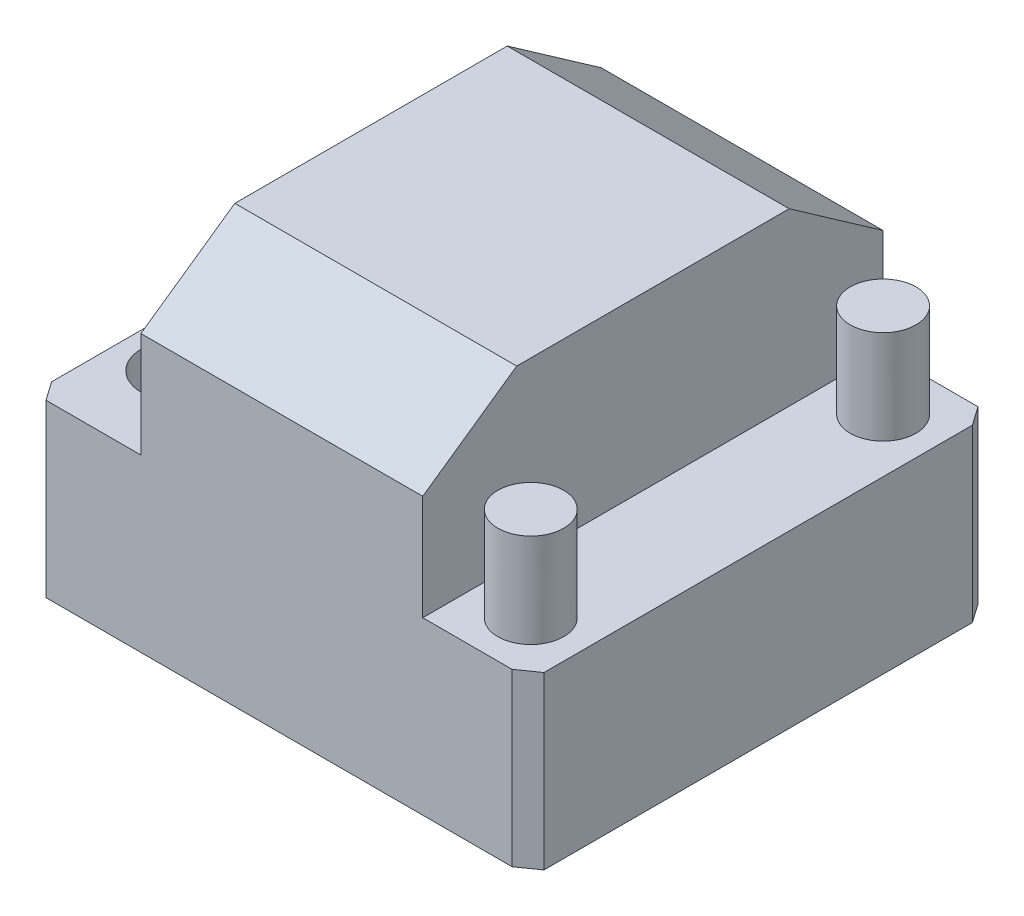
ISO-10303-21;
HEADER;
FILE_DESCRIPTION(('STEP AP214'),'2;1');
FILE_NAME('part.step','',(''),(''),'','','');
FILE_SCHEMA(('AUTOMOTIVE_DESIGN { 1 0 10303 214 1 1 1 1 }'));
ENDSEC;
DATA;
#1=APPLICATION_CONTEXT('core data for automotive mechanical design processes');
#2=APPLICATION_PROTOCOL_DEFINITION('international standard','automotive_design',2000,#1);
#3=PRODUCT_CONTEXT('',#1,'mechanical');
#4=PRODUCT('Part','Part','',(#3));
#5=PRODUCT_RELATED_PRODUCT_CATEGORY('part','',(#4));
#6=PRODUCT_DEFINITION_FORMATION('','',#4);
#7=PRODUCT_DEFINITION_CONTEXT('part definition',#1,'design');
#8=PRODUCT_DEFINITION('design','',#6,#7);
#9=PRODUCT_DEFINITION_SHAPE('','',#8);
#10=(LENGTH_UNIT() NAMED_UNIT(*) SI_UNIT(.MILLI.,.METRE.));
#11=(NAMED_UNIT(*) PLANE_ANGLE_UNIT() SI_UNIT($,.RADIAN.));
#12=(NAMED_UNIT(*) SI_UNIT($,.STERADIAN.) SOLID_ANGLE_UNIT());
#13=UNCERTAINTY_MEASURE_WITH_UNIT(LENGTH_MEASURE(1.E-05),#10,'distance_accuracy_value','');
#14=(GEOMETRIC_REPRESENTATION_CONTEXT(3) GLOBAL_UNCERTAINTY_ASSIGNED_CONTEXT((#13)) GLOBAL_UNIT_ASSIGNED_CONTEXT((#10,
#11,#12)) REPRESENTATION_CONTEXT('',''));
#15=CARTESIAN_POINT('',(0.,0.,0.));
#16=DIRECTION('',(0.,0.,1.));
#17=DIRECTION('',(1.,0.,0.));
#18=AXIS2_PLACEMENT_3D('',#15,#16,#17);
#19=CARTESIAN_POINT('',(-26.5,36.4,-24.5));
#20=DIRECTION('',(1.,0.,0.));
#21=DIRECTION('',(0.,0.,-1.));
#22=AXIS2_PLACEMENT_3D('',#19,#20,#21);
#23=PLANE('',#22);
#24=DIRECTION('',(0.,0.,1.));
#25=VECTOR('',#24,1.);
#26=CARTESIAN_POINT('',(-26.5,18.2,-24.5));
#27=LINE('',#26,#25);
#28=CARTESIAN_POINT('',(-26.5,18.2,-23.0995849235806));
#29=VERTEX_POINT('',#28);
#30=CARTESIAN_POINT('',(-26.5,18.2,22.5));
#31=VERTEX_POINT('',#30);
#32=EDGE_CURVE('E173',#29,#31,#27,.T.);
#33=ORIENTED_EDGE('',*,*,#32,.F.);
#34=DIRECTION('',(0.,-1.,0.));
#35=VECTOR('',#34,1.);
#36=CARTESIAN_POINT('',(-26.5,36.4,-23.0995849235806));
#37=LINE('',#36,#35);
#38=CARTESIAN_POINT('',(-26.5,0.,-23.0995849235806));
#39=VERTEX_POINT('',#38);
#40=EDGE_CURVE('E259',#29,#39,#37,.T.);
#41=ORIENTED_EDGE('',*,*,#40,.T.);
#42=DIRECTION('',(0.,0.,1.));
#43=VECTOR('',#42,1.);
#44=CARTESIAN_POINT('',(-26.5,0.,-24.5));
#45=LINE('',#44,#43);
#46=CARTESIAN_POINT('',(-26.5,0.,22.5));
#47=VERTEX_POINT('',#46);
#48=EDGE_CURVE('E186',#39,#47,#45,.T.);
#49=ORIENTED_EDGE('',*,*,#48,.T.);
#50=DIRECTION('',(0.,1.,0.));
#51=VECTOR('',#50,1.);
#52=CARTESIAN_POINT('',(-26.5,36.4,22.5));
#53=LINE('',#52,#51);
#54=EDGE_CURVE('E65',#47,#31,#53,.T.);
#55=ORIENTED_EDGE('',*,*,#54,.T.);
#56=EDGE_LOOP('',(#33,#41,#49,#55));
#57=FACE_BOUND('',#56,.T.);
#58=ADVANCED_FACE('F49',(#57),#23,.F.);
#59=CARTESIAN_POINT('',(-26.5,36.4,24.5));
#60=DIRECTION('',(0.,0.,-1.));
#61=DIRECTION('',(-1.,0.,0.));
#62=AXIS2_PLACEMENT_3D('',#59,#60,#61);
#63=PLANE('',#62);
#64=DIRECTION('',(1.,0.,0.));
#65=VECTOR('',#64,1.);
#66=CARTESIAN_POINT('',(-26.5,0.,24.5));
#67=LINE('',#66,#65);
#68=CARTESIAN_POINT('',(-25.0995849235806,0.,24.5));
#69=VERTEX_POINT('',#68);
#70=CARTESIAN_POINT('',(24.5,0.,24.5));
#71=VERTEX_POINT('',#70);
#72=EDGE_CURVE('E207',#69,#71,#67,.T.);
#73=ORIENTED_EDGE('',*,*,#72,.T.);
#74=DIRECTION('',(0.,1.,0.));
#75=VECTOR('',#74,1.);
#76=CARTESIAN_POINT('',(24.5,36.4,24.5));
#77=LINE('',#76,#75);
#78=CARTESIAN_POINT('',(24.5,18.2,24.5));
#79=VERTEX_POINT('',#78);
#80=EDGE_CURVE('E256',#71,#79,#77,.T.);
#81=ORIENTED_EDGE('',*,*,#80,.T.);
#82=DIRECTION('',(1.,0.,0.));
#83=VECTOR('',#82,1.);
#84=CARTESIAN_POINT('',(26.5,18.2,24.5));
#85=LINE('',#84,#83);
#86=CARTESIAN_POINT('',(15.,18.2,24.5));
#87=VERTEX_POINT('',#86);
#88=EDGE_CURVE('E199',#87,#79,#85,.T.);
#89=ORIENTED_EDGE('',*,*,#88,.F.);
#90=DIRECTION('',(0.,-1.,0.));
#91=VECTOR('',#90,1.);
#92=CARTESIAN_POINT('',(15.,36.4,24.5));
#93=LINE('',#92,#91);
#94=CARTESIAN_POINT('',(15.,29.3979246179029,24.5));
#95=VERTEX_POINT('',#94);
#96=EDGE_CURVE('E183',#95,#87,#93,.T.);
#97=ORIENTED_EDGE('',*,*,#96,.F.);
#98=DIRECTION('',(-1.,0.,0.));
#99=VECTOR('',#98,1.);
#100=CARTESIAN_POINT('',(-15.,29.3979246179029,24.5));
#101=LINE('',#100,#99);
#102=CARTESIAN_POINT('',(-15.,29.3979246179029,24.5));
#103=VERTEX_POINT('',#102);
#104=EDGE_CURVE('E230',#95,#103,#101,.T.);
#105=ORIENTED_EDGE('',*,*,#104,.T.);
#106=DIRECTION('',(0.,1.,0.));
#107=VECTOR('',#106,1.);
#108=CARTESIAN_POINT('',(-15.,36.4,24.5));
#109=LINE('',#108,#107);
#110=CARTESIAN_POINT('',(-15.,18.2,24.5));
#111=VERTEX_POINT('',#110);
#112=EDGE_CURVE('E162',#111,#103,#109,.T.);
#113=ORIENTED_EDGE('',*,*,#112,.F.);
#114=DIRECTION('',(1.,0.,0.));
#115=VECTOR('',#114,1.);
#116=CARTESIAN_POINT('',(-26.5,18.2,24.5));
#117=LINE('',#116,#115);
#118=CARTESIAN_POINT('',(-25.0995849235806,18.2,24.5));
#119=VERTEX_POINT('',#118);
#120=EDGE_CURVE('E168',#119,#111,#117,.T.);
#121=ORIENTED_EDGE('',*,*,#120,.F.);
#122=DIRECTION('',(0.,-1.,0.));
#123=VECTOR('',#122,1.);
#124=CARTESIAN_POINT('',(-25.0995849235806,36.4,24.5));
#125=LINE('',#124,#123);
#126=EDGE_CURVE('E253',#119,#69,#125,.T.);
#127=ORIENTED_EDGE('',*,*,#126,.T.);
#128=EDGE_LOOP('',(#73,#81,#89,#97,#105,#113,#121,#127));
#129=FACE_BOUND('',#128,.T.);
#130=ADVANCED_FACE('F298',(#129),#63,.F.);
#131=CARTESIAN_POINT('',(26.5,36.4,-24.5));
#132=DIRECTION('',(-1.,0.,0.));
#133=DIRECTION('',(0.,0.,1.));
#134=AXIS2_PLACEMENT_3D('',#131,#132,#133);
#135=PLANE('',#134);
#136=DIRECTION('',(0.,0.,-1.));
#137=VECTOR('',#136,1.);
#138=CARTESIAN_POINT('',(26.5,0.,-24.5));
#139=LINE('',#138,#137);
#140=CARTESIAN_POINT('',(26.5,0.,23.0995849235806));
#141=VERTEX_POINT('',#140);
#142=CARTESIAN_POINT('',(26.5,0.,-22.5));
#143=VERTEX_POINT('',#142);
#144=EDGE_CURVE('E210',#141,#143,#139,.T.);
#145=ORIENTED_EDGE('',*,*,#144,.T.);
#146=DIRECTION('',(0.,1.,0.));
#147=VECTOR('',#146,1.);
#148=CARTESIAN_POINT('',(26.5,36.4,-22.5));
#149=LINE('',#148,#147);
#150=CARTESIAN_POINT('',(26.5,18.2,-22.5));
#151=VERTEX_POINT('',#150);
#152=EDGE_CURVE('E247',#143,#151,#149,.T.);
#153=ORIENTED_EDGE('',*,*,#152,.T.);
#154=DIRECTION('',(0.,0.,1.));
#155=VECTOR('',#154,1.);
#156=CARTESIAN_POINT('',(26.5,18.2,-24.5));
#157=LINE('',#156,#155);
#158=CARTESIAN_POINT('',(26.5,18.2,23.0995849235806));
#159=VERTEX_POINT('',#158);
#160=EDGE_CURVE('E195',#151,#159,#157,.T.);
#161=ORIENTED_EDGE('',*,*,#160,.T.);
#162=DIRECTION('',(0.,-1.,0.));
#163=VECTOR('',#162,1.);
#164=CARTESIAN_POINT('',(26.5,36.4,23.0995849235806));
#165=LINE('',#164,#163);
#166=EDGE_CURVE('E244',#159,#141,#165,.T.);
#167=ORIENTED_EDGE('',*,*,#166,.T.);
#168=EDGE_LOOP('',(#145,#153,#161,#167));
#169=FACE_BOUND('',#168,.T.);
#170=ADVANCED_FACE('F302',(#169),#135,.F.);
#171=CARTESIAN_POINT('',(-26.5,36.4,-24.5));
#172=DIRECTION('',(0.,0.,1.));
#173=DIRECTION('',(1.,0.,0.));
#174=AXIS2_PLACEMENT_3D('',#171,#172,#173);
#175=PLANE('',#174);
#176=DIRECTION('',(1.,0.,0.));
#177=VECTOR('',#176,1.);
#178=CARTESIAN_POINT('',(26.5,18.2,-24.5));
#179=LINE('',#178,#177);
#180=CARTESIAN_POINT('',(15.,18.2,-24.5));
#181=VERTEX_POINT('',#180);
#182=CARTESIAN_POINT('',(25.0995849235806,18.2,-24.5));
#183=VERTEX_POINT('',#182);
#184=EDGE_CURVE('E191',#181,#183,#179,.T.);
#185=ORIENTED_EDGE('',*,*,#184,.T.);
#186=DIRECTION('',(0.,-1.,0.));
#187=VECTOR('',#186,1.);
#188=CARTESIAN_POINT('',(25.0995849235806,36.4,-24.5));
#189=LINE('',#188,#187);
#190=CARTESIAN_POINT('',(25.0995849235806,0.,-24.5));
#191=VERTEX_POINT('',#190);
#192=EDGE_CURVE('E233',#183,#191,#189,.T.);
#193=ORIENTED_EDGE('',*,*,#192,.T.);
#194=DIRECTION('',(-1.,0.,0.));
#195=VECTOR('',#194,1.);
#196=CARTESIAN_POINT('',(-26.5,0.,-24.5));
#197=LINE('',#196,#195);
#198=CARTESIAN_POINT('',(-24.5,0.,-24.5));
#199=VERTEX_POINT('',#198);
#200=EDGE_CURVE('E213',#191,#199,#197,.T.);
#201=ORIENTED_EDGE('',*,*,#200,.T.);
#202=DIRECTION('',(0.,1.,0.));
#203=VECTOR('',#202,1.);
#204=CARTESIAN_POINT('',(-24.5,36.4,-24.5));
#205=LINE('',#204,#203);
#206=CARTESIAN_POINT('',(-24.5,18.2,-24.5));
#207=VERTEX_POINT('',#206);
#208=EDGE_CURVE('E161',#199,#207,#205,.T.);
#209=ORIENTED_EDGE('',*,*,#208,.T.);
#210=DIRECTION('',(1.,0.,0.));
#211=VECTOR('',#210,1.);
#212=CARTESIAN_POINT('',(-26.5,18.2,-24.5));
#213=LINE('',#212,#211);
#214=CARTESIAN_POINT('',(-15.,18.2,-24.5));
#215=VERTEX_POINT('',#214);
#216=EDGE_CURVE('E152',#207,#215,#213,.T.);
#217=ORIENTED_EDGE('',*,*,#216,.T.);
#218=DIRECTION('',(0.,1.,0.));
#219=VECTOR('',#218,1.);
#220=CARTESIAN_POINT('',(-15.,36.4,-24.5));
#221=LINE('',#220,#219);
#222=CARTESIAN_POINT('',(-15.,29.3979246179029,-24.5));
#223=VERTEX_POINT('',#222);
#224=EDGE_CURVE('E157',#215,#223,#221,.T.);
#225=ORIENTED_EDGE('',*,*,#224,.T.);
#226=DIRECTION('',(1.,0.,0.));
#227=VECTOR('',#226,1.);
#228=CARTESIAN_POINT('',(15.,29.3979246179029,-24.5));
#229=LINE('',#228,#227);
#230=CARTESIAN_POINT('',(15.,29.3979246179029,-24.5));
#231=VERTEX_POINT('',#230);
#232=EDGE_CURVE('E224',#223,#231,#229,.T.);
#233=ORIENTED_EDGE('',*,*,#232,.T.);
#234=DIRECTION('',(0.,-1.,0.));
#235=VECTOR('',#234,1.);
#236=CARTESIAN_POINT('',(15.,36.4,-24.5));
#237=LINE('',#236,#235);
#238=EDGE_CURVE('E202',#231,#181,#237,.T.);
#239=ORIENTED_EDGE('',*,*,#238,.T.);
#240=EDGE_LOOP('',(#185,#193,#201,#209,#217,#225,#233,#239));
#241=FACE_BOUND('',#240,.T.);
#242=ADVANCED_FACE('F155',(#241),#175,.F.);
#243=CARTESIAN_POINT('',(0.,36.4,0.));
#244=DIRECTION('',(0.,1.,0.));
#245=DIRECTION('',(0.,0.,1.));
#246=AXIS2_PLACEMENT_3D('',#243,#244,#245);
#247=PLANE('',#246);
#248=DIRECTION('',(0.,0.,1.));
#249=VECTOR('',#248,1.);
#250=CARTESIAN_POINT('',(15.,36.4,-24.5));
#251=LINE('',#250,#249);
#252=CARTESIAN_POINT('',(15.,36.4,-14.4999999999999));
#253=VERTEX_POINT('',#252);
#254=CARTESIAN_POINT('',(15.,36.4,14.4999999999999));
#255=VERTEX_POINT('',#254);
#256=EDGE_CURVE('E188',#253,#255,#251,.T.);
#257=ORIENTED_EDGE('',*,*,#256,.F.);
#258=DIRECTION('',(-1.,0.,0.));
#259=VECTOR('',#258,1.);
#260=CARTESIAN_POINT('',(-15.,36.4,-14.4999999999999));
#261=LINE('',#260,#259);
#262=CARTESIAN_POINT('',(-15.,36.4,-14.4999999999999));
#263=VERTEX_POINT('',#262);
#264=EDGE_CURVE('E218',#253,#263,#261,.T.);
#265=ORIENTED_EDGE('',*,*,#264,.T.);
#266=DIRECTION('',(0.,0.,1.));
#267=VECTOR('',#266,1.);
#268=CARTESIAN_POINT('',(-15.,36.4,-24.5));
#269=LINE('',#268,#267);
#270=CARTESIAN_POINT('',(-15.,36.4,14.4999999999999));
#271=VERTEX_POINT('',#270);
#272=EDGE_CURVE('E172',#263,#271,#269,.T.);
#273=ORIENTED_EDGE('',*,*,#272,.T.);
#274=DIRECTION('',(1.,0.,0.));
#275=VECTOR('',#274,1.);
#276=CARTESIAN_POINT('',(15.,36.4,14.4999999999999));
#277=LINE('',#276,#275);
#278=EDGE_CURVE('E215',#271,#255,#277,.T.);
#279=ORIENTED_EDGE('',*,*,#278,.T.);
#280=EDGE_LOOP('',(#257,#265,#273,#279));
#281=FACE_BOUND('',#280,.T.);
#282=ADVANCED_FACE('F309',(#281),#247,.T.);
#283=CARTESIAN_POINT('',(0.,0.,0.));
#284=DIRECTION('',(0.,1.,0.));
#285=DIRECTION('',(0.,0.,1.));
#286=AXIS2_PLACEMENT_3D('',#283,#284,#285);
#287=PLANE('',#286);
#288=ORIENTED_EDGE('',*,*,#200,.F.);
#289=DIRECTION('',(-0.573576436351043,0.,-0.819152044288994));
#290=VECTOR('',#289,1.);
#291=CARTESIAN_POINT('',(25.0995849235806,0.,-24.5));
#292=LINE('',#291,#290);
#293=EDGE_CURVE('E242',#191,#143,#292,.F.);
#294=ORIENTED_EDGE('',*,*,#293,.T.);
#295=ORIENTED_EDGE('',*,*,#144,.F.);
#296=DIRECTION('',(0.819152044288994,0.,-0.573576436351044));
#297=VECTOR('',#296,1.);
#298=CARTESIAN_POINT('',(26.5,0.,23.0995849235806));
#299=LINE('',#298,#297);
#300=EDGE_CURVE('E240',#141,#71,#299,.F.);
#301=ORIENTED_EDGE('',*,*,#300,.T.);
#302=ORIENTED_EDGE('',*,*,#72,.F.);
#303=DIRECTION('',(0.573576436351043,0.,0.819152044288994));
#304=VECTOR('',#303,1.);
#305=CARTESIAN_POINT('',(-25.0995849235806,0.,24.5));
#306=LINE('',#305,#304);
#307=EDGE_CURVE('E236',#69,#47,#306,.F.);
#308=ORIENTED_EDGE('',*,*,#307,.T.);
#309=ORIENTED_EDGE('',*,*,#48,.F.);
#310=DIRECTION('',(-0.819152044288993,0.,0.573576436351044));
#311=VECTOR('',#310,1.);
#312=CARTESIAN_POINT('',(-26.5,0.,-23.0995849235806));
#313=LINE('',#312,#311);
#314=EDGE_CURVE('E238',#39,#199,#313,.F.);
#315=ORIENTED_EDGE('',*,*,#314,.T.);
#316=EDGE_LOOP('',(#288,#294,#295,#301,#302,#308,#309,#315));
#317=FACE_BOUND('',#316,.T.);
#318=ADVANCED_FACE('F273',(#317),#287,.F.);
#319=CARTESIAN_POINT('',(26.5,18.2,-24.5));
#320=DIRECTION('',(0.,-1.,0.));
#321=DIRECTION('',(0.,0.,-1.));
#322=AXIS2_PLACEMENT_3D('',#319,#320,#321);
#323=PLANE('',#322);
#324=CARTESIAN_POINT('',(20.75,18.2,-18.75));
#325=DIRECTION('',(0.,-1.,0.));
#326=DIRECTION('',(0.,0.,-1.));
#327=AXIS2_PLACEMENT_3D('',#324,#325,#326);
#328=CIRCLE('',#327,3.5);
#329=CARTESIAN_POINT('',(20.75,18.2,-22.25));
#330=VERTEX_POINT('',#329);
#331=EDGE_CURVE('E11',#330,#330,#328,.F.);
#332=ORIENTED_EDGE('',*,*,#331,.F.);
#333=EDGE_LOOP('',(#332));
#334=FACE_BOUND('',#333,.T.);
#335=CARTESIAN_POINT('',(20.75,18.2,18.75));
#336=DIRECTION('',(0.,-1.,0.));
#337=DIRECTION('',(0.,0.,-1.));
#338=AXIS2_PLACEMENT_3D('',#335,#336,#337);
#339=CIRCLE('',#338,3.5);
#340=CARTESIAN_POINT('',(20.75,18.2,15.25));
#341=VERTEX_POINT('',#340);
#342=EDGE_CURVE('E58',#341,#341,#339,.F.);
#343=ORIENTED_EDGE('',*,*,#342,.F.);
#344=EDGE_LOOP('',(#343));
#345=FACE_BOUND('',#344,.T.);
#346=ORIENTED_EDGE('',*,*,#160,.F.);
#347=DIRECTION('',(0.573576436351043,0.,0.819152044288994));
#348=VECTOR('',#347,1.);
#349=CARTESIAN_POINT('',(25.0995849235806,18.2,-24.5));
#350=LINE('',#349,#348);
#351=EDGE_CURVE('E251',#151,#183,#350,.F.);
#352=ORIENTED_EDGE('',*,*,#351,.T.);
#353=ORIENTED_EDGE('',*,*,#184,.F.);
#354=DIRECTION('',(0.,0.,1.));
#355=VECTOR('',#354,1.);
#356=CARTESIAN_POINT('',(15.,18.2,-24.5));
#357=LINE('',#356,#355);
#358=EDGE_CURVE('E192',#181,#87,#357,.T.);
#359=ORIENTED_EDGE('',*,*,#358,.T.);
#360=ORIENTED_EDGE('',*,*,#88,.T.);
#361=DIRECTION('',(-0.819152044288994,0.,0.573576436351044));
#362=VECTOR('',#361,1.);
#363=CARTESIAN_POINT('',(26.5,18.2,23.0995849235806));
#364=LINE('',#363,#362);
#365=EDGE_CURVE('E249',#79,#159,#364,.F.);
#366=ORIENTED_EDGE('',*,*,#365,.T.);
#367=EDGE_LOOP('',(#346,#352,#353,#359,#360,#366));
#368=FACE_BOUND('',#367,.T.);
#369=ADVANCED_FACE('F269',(#334,#345,#368),#323,.F.);
#370=CARTESIAN_POINT('',(15.,36.4,-24.5));
#371=DIRECTION('',(-1.,0.,0.));
#372=DIRECTION('',(0.,0.,1.));
#373=AXIS2_PLACEMENT_3D('',#370,#371,#372);
#374=PLANE('',#373);
#375=ORIENTED_EDGE('',*,*,#238,.F.);
#376=DIRECTION('',(0.,0.573576436351044,0.819152044288993));
#377=VECTOR('',#376,1.);
#378=CARTESIAN_POINT('',(15.,36.4,-14.4999999999999));
#379=LINE('',#378,#377);
#380=EDGE_CURVE('E228',#231,#253,#379,.T.);
#381=ORIENTED_EDGE('',*,*,#380,.T.);
#382=ORIENTED_EDGE('',*,*,#256,.T.);
#383=DIRECTION('',(0.,-0.573576436351044,0.819152044288993));
#384=VECTOR('',#383,1.);
#385=CARTESIAN_POINT('',(15.,36.4,14.4999999999999));
#386=LINE('',#385,#384);
#387=EDGE_CURVE('E226',#255,#95,#386,.T.);
#388=ORIENTED_EDGE('',*,*,#387,.T.);
#389=ORIENTED_EDGE('',*,*,#96,.T.);
#390=ORIENTED_EDGE('',*,*,#358,.F.);
#391=EDGE_LOOP('',(#375,#381,#382,#388,#389,#390));
#392=FACE_BOUND('',#391,.T.);
#393=ADVANCED_FACE('F272',(#392),#374,.F.);
#394=CARTESIAN_POINT('',(-15.,36.4,-24.5));
#395=DIRECTION('',(1.,0.,0.));
#396=DIRECTION('',(0.,0.,-1.));
#397=AXIS2_PLACEMENT_3D('',#394,#395,#396);
#398=PLANE('',#397);
#399=ORIENTED_EDGE('',*,*,#272,.F.);
#400=DIRECTION('',(0.,-0.573576436351044,-0.819152044288993));
#401=VECTOR('',#400,1.);
#402=CARTESIAN_POINT('',(-15.,36.4,-14.4999999999999));
#403=LINE('',#402,#401);
#404=EDGE_CURVE('E177',#263,#223,#403,.T.);
#405=ORIENTED_EDGE('',*,*,#404,.T.);
#406=ORIENTED_EDGE('',*,*,#224,.F.);
#407=DIRECTION('',(0.,0.,1.));
#408=VECTOR('',#407,1.);
#409=CARTESIAN_POINT('',(-15.,18.2,-24.5));
#410=LINE('',#409,#408);
#411=EDGE_CURVE('E165',#215,#111,#410,.T.);
#412=ORIENTED_EDGE('',*,*,#411,.T.);
#413=ORIENTED_EDGE('',*,*,#112,.T.);
#414=DIRECTION('',(0.,0.573576436351044,-0.819152044288993));
#415=VECTOR('',#414,1.);
#416=CARTESIAN_POINT('',(-15.,36.4,14.4999999999999));
#417=LINE('',#416,#415);
#418=EDGE_CURVE('E221',#103,#271,#417,.T.);
#419=ORIENTED_EDGE('',*,*,#418,.T.);
#420=EDGE_LOOP('',(#399,#405,#406,#412,#413,#419));
#421=FACE_BOUND('',#420,.T.);
#422=ADVANCED_FACE('F176',(#421),#398,.F.);
#423=CARTESIAN_POINT('',(-26.5,18.2,-24.5));
#424=DIRECTION('',(0.,-1.,0.));
#425=DIRECTION('',(0.,0.,-1.));
#426=AXIS2_PLACEMENT_3D('',#423,#424,#425);
#427=PLANE('',#426);
#428=CARTESIAN_POINT('',(-20.75,18.2,-15.2997924617903));
#429=DIRECTION('',(0.,1.,0.));
#430=DIRECTION('',(0.,0.,1.));
#431=AXIS2_PLACEMENT_3D('',#428,#429,#430);
#432=CIRCLE('',#431,4.);
#433=CARTESIAN_POINT('',(-20.75,18.2,-11.2997924617903));
#434=VERTEX_POINT('',#433);
#435=EDGE_CURVE('E573',#434,#434,#432,.T.);
#436=ORIENTED_EDGE('',*,*,#435,.F.);
#437=EDGE_LOOP('',(#436));
#438=FACE_BOUND('',#437,.T.);
#439=CARTESIAN_POINT('',(-20.75,18.2,14.7002075382097));
#440=DIRECTION('',(0.,1.,0.));
#441=DIRECTION('',(0.,0.,1.));
#442=AXIS2_PLACEMENT_3D('',#439,#440,#441);
#443=CIRCLE('',#442,4.);
#444=CARTESIAN_POINT('',(-20.75,18.2,18.7002075382097));
#445=VERTEX_POINT('',#444);
#446=EDGE_CURVE('E578',#445,#445,#443,.T.);
#447=ORIENTED_EDGE('',*,*,#446,.F.);
#448=EDGE_LOOP('',(#447));
#449=FACE_BOUND('',#448,.T.);
#450=CARTESIAN_POINT('',(-20.75,18.2,-0.299792461790307));
#451=DIRECTION('',(0.,1.,0.));
#452=DIRECTION('',(0.,0.,1.));
#453=AXIS2_PLACEMENT_3D('',#450,#451,#452);
#454=CIRCLE('',#453,4.);
#455=CARTESIAN_POINT('',(-20.75,18.2,3.70020753820969));
#456=VERTEX_POINT('',#455);
#457=EDGE_CURVE('E586',#456,#456,#454,.T.);
#458=ORIENTED_EDGE('',*,*,#457,.F.);
#459=EDGE_LOOP('',(#458));
#460=FACE_BOUND('',#459,.T.);
#461=ORIENTED_EDGE('',*,*,#216,.F.);
#462=DIRECTION('',(0.819152044288993,0.,-0.573576436351044));
#463=VECTOR('',#462,1.);
#464=CARTESIAN_POINT('',(-26.5,18.2,-23.0995849235806));
#465=LINE('',#464,#463);
#466=EDGE_CURVE('E72',#207,#29,#465,.F.);
#467=ORIENTED_EDGE('',*,*,#466,.T.);
#468=ORIENTED_EDGE('',*,*,#32,.T.);
#469=DIRECTION('',(-0.573576436351043,0.,-0.819152044288994));
#470=VECTOR('',#469,1.);
#471=CARTESIAN_POINT('',(-25.0995849235806,18.2,24.5));
#472=LINE('',#471,#470);
#473=EDGE_CURVE('E262',#31,#119,#472,.F.);
#474=ORIENTED_EDGE('',*,*,#473,.T.);
#475=ORIENTED_EDGE('',*,*,#120,.T.);
#476=ORIENTED_EDGE('',*,*,#411,.F.);
#477=EDGE_LOOP('',(#461,#467,#468,#474,#475,#476));
#478=FACE_BOUND('',#477,.T.);
#479=ADVANCED_FACE('F166',(#438,#449,#460,#478),#427,.F.);
#480=CARTESIAN_POINT('',(0.,36.4,-14.4999999999999));
#481=DIRECTION('',(0.,0.819152044288993,-0.573576436351044));
#482=DIRECTION('',(1.,0.,0.));
#483=AXIS2_PLACEMENT_3D('',#480,#481,#482);
#484=PLANE('',#483);
#485=ORIENTED_EDGE('',*,*,#380,.F.);
#486=ORIENTED_EDGE('',*,*,#232,.F.);
#487=ORIENTED_EDGE('',*,*,#404,.F.);
#488=ORIENTED_EDGE('',*,*,#264,.F.);
#489=EDGE_LOOP('',(#485,#486,#487,#488));
#490=FACE_BOUND('',#489,.T.);
#491=ADVANCED_FACE('F319',(#490),#484,.T.);
#492=CARTESIAN_POINT('',(0.,36.4,14.4999999999999));
#493=DIRECTION('',(0.,0.819152044288993,0.573576436351044));
#494=DIRECTION('',(-1.,0.,0.));
#495=AXIS2_PLACEMENT_3D('',#492,#493,#494);
#496=PLANE('',#495);
#497=ORIENTED_EDGE('',*,*,#418,.F.);
#498=ORIENTED_EDGE('',*,*,#104,.F.);
#499=ORIENTED_EDGE('',*,*,#387,.F.);
#500=ORIENTED_EDGE('',*,*,#278,.F.);
#501=EDGE_LOOP('',(#497,#498,#499,#500));
#502=FACE_BOUND('',#501,.T.);
#503=ADVANCED_FACE('F325',(#502),#496,.T.);
#504=CARTESIAN_POINT('',(25.0995849235806,36.4,-24.5));
#505=DIRECTION('',(-0.819152044288994,0.,0.573576436351043));
#506=DIRECTION('',(0.,-1.,0.));
#507=AXIS2_PLACEMENT_3D('',#504,#505,#506);
#508=PLANE('',#507);
#509=ORIENTED_EDGE('',*,*,#351,.F.);
#510=ORIENTED_EDGE('',*,*,#152,.F.);
#511=ORIENTED_EDGE('',*,*,#293,.F.);
#512=ORIENTED_EDGE('',*,*,#192,.F.);
#513=EDGE_LOOP('',(#509,#510,#511,#512));
#514=FACE_BOUND('',#513,.T.);
#515=ADVANCED_FACE('F285',(#514),#508,.F.);
#516=CARTESIAN_POINT('',(26.5,36.4,23.0995849235806));
#517=DIRECTION('',(-0.573576436351044,0.,-0.819152044288994));
#518=DIRECTION('',(0.,-1.,0.));
#519=AXIS2_PLACEMENT_3D('',#516,#517,#518);
#520=PLANE('',#519);
#521=ORIENTED_EDGE('',*,*,#365,.F.);
#522=ORIENTED_EDGE('',*,*,#80,.F.);
#523=ORIENTED_EDGE('',*,*,#300,.F.);
#524=ORIENTED_EDGE('',*,*,#166,.F.);
#525=EDGE_LOOP('',(#521,#522,#523,#524));
#526=FACE_BOUND('',#525,.T.);
#527=ADVANCED_FACE('F301',(#526),#520,.F.);
#528=CARTESIAN_POINT('',(-26.5,36.4,-23.0995849235806));
#529=DIRECTION('',(0.573576436351044,0.,0.819152044288993));
#530=DIRECTION('',(0.,-1.,0.));
#531=AXIS2_PLACEMENT_3D('',#528,#529,#530);
#532=PLANE('',#531);
#533=ORIENTED_EDGE('',*,*,#466,.F.);
#534=ORIENTED_EDGE('',*,*,#208,.F.);
#535=ORIENTED_EDGE('',*,*,#314,.F.);
#536=ORIENTED_EDGE('',*,*,#40,.F.);
#537=EDGE_LOOP('',(#533,#534,#535,#536));
#538=FACE_BOUND('',#537,.T.);
#539=ADVANCED_FACE('F292',(#538),#532,.F.);
#540=CARTESIAN_POINT('',(-25.0995849235806,36.4,24.5));
#541=DIRECTION('',(0.819152044288994,0.,-0.573576436351043));
#542=DIRECTION('',(0.,-1.,0.));
#543=AXIS2_PLACEMENT_3D('',#540,#541,#542);
#544=PLANE('',#543);
#545=ORIENTED_EDGE('',*,*,#473,.F.);
#546=ORIENTED_EDGE('',*,*,#54,.F.);
#547=ORIENTED_EDGE('',*,*,#307,.F.);
#548=ORIENTED_EDGE('',*,*,#126,.F.);
#549=EDGE_LOOP('',(#545,#546,#547,#548));
#550=FACE_BOUND('',#549,.T.);
#551=ADVANCED_FACE('F52',(#550),#544,.F.);
#552=CARTESIAN_POINT('',(20.75,28.2,18.75));
#553=DIRECTION('',(0.,-1.,0.));
#554=DIRECTION('',(0.,0.,-1.));
#555=AXIS2_PLACEMENT_3D('',#552,#553,#554);
#556=CYLINDRICAL_SURFACE('',#555,3.5);
#557=CARTESIAN_POINT('',(20.75,28.2,18.75));
#558=DIRECTION('',(0.,1.,0.));
#559=DIRECTION('',(0.,0.,1.));
#560=AXIS2_PLACEMENT_3D('',#557,#558,#559);
#561=CIRCLE('',#560,3.5);
#562=CARTESIAN_POINT('',(20.75,28.2,22.25));
#563=VERTEX_POINT('',#562);
#564=EDGE_CURVE('E198',#563,#563,#561,.T.);
#565=ORIENTED_EDGE('',*,*,#564,.F.);
#566=EDGE_LOOP('',(#565));
#567=FACE_BOUND('',#566,.T.);
#568=ORIENTED_EDGE('',*,*,#342,.T.);
#569=EDGE_LOOP('',(#568));
#570=FACE_BOUND('',#569,.T.);
#571=ADVANCED_FACE('F267',(#567,#570),#556,.T.);
#572=CARTESIAN_POINT('',(20.75,28.2,18.75));
#573=DIRECTION('',(0.,1.,0.));
#574=DIRECTION('',(0.,0.,1.));
#575=AXIS2_PLACEMENT_3D('',#572,#573,#574);
#576=PLANE('',#575);
#577=ORIENTED_EDGE('',*,*,#564,.T.);
#578=EDGE_LOOP('',(#577));
#579=FACE_BOUND('',#578,.T.);
#580=ADVANCED_FACE('F350',(#579),#576,.T.);
#581=CARTESIAN_POINT('',(20.75,28.2,-18.75));
#582=DIRECTION('',(0.,-1.,0.));
#583=DIRECTION('',(0.,0.,-1.));
#584=AXIS2_PLACEMENT_3D('',#581,#582,#583);
#585=CYLINDRICAL_SURFACE('',#584,3.5);
#586=CARTESIAN_POINT('',(20.75,28.2,-18.75));
#587=DIRECTION('',(0.,1.,0.));
#588=DIRECTION('',(0.,0.,1.));
#589=AXIS2_PLACEMENT_3D('',#586,#587,#588);
#590=CIRCLE('',#589,3.5);
#591=CARTESIAN_POINT('',(20.75,28.2,-15.25));
#592=VERTEX_POINT('',#591);
#593=EDGE_CURVE('E572',#592,#592,#590,.T.);
#594=ORIENTED_EDGE('',*,*,#593,.F.);
#595=EDGE_LOOP('',(#594));
#596=FACE_BOUND('',#595,.T.);
#597=ORIENTED_EDGE('',*,*,#331,.T.);
#598=EDGE_LOOP('',(#597));
#599=FACE_BOUND('',#598,.T.);
#600=ADVANCED_FACE('F356',(#596,#599),#585,.T.);
#601=CARTESIAN_POINT('',(20.75,28.2,-18.75));
#602=DIRECTION('',(0.,1.,0.));
#603=DIRECTION('',(0.,0.,1.));
#604=AXIS2_PLACEMENT_3D('',#601,#602,#603);
#605=PLANE('',#604);
#606=ORIENTED_EDGE('',*,*,#593,.T.);
#607=EDGE_LOOP('',(#606));
#608=FACE_BOUND('',#607,.T.);
#609=ADVANCED_FACE('F426',(#608),#605,.T.);
#610=CARTESIAN_POINT('',(-20.75,8.2,-0.299792461790307));
#611=DIRECTION('',(0.,1.,0.));
#612=DIRECTION('',(0.,0.,1.));
#613=AXIS2_PLACEMENT_3D('',#610,#611,#612);
#614=CYLINDRICAL_SURFACE('',#613,4.);
#615=CARTESIAN_POINT('',(-20.75,8.2,-0.299792461790307));
#616=DIRECTION('',(0.,1.,0.));
#617=DIRECTION('',(0.,0.,1.));
#618=AXIS2_PLACEMENT_3D('',#615,#616,#617);
#619=CIRCLE('',#618,4.);
#620=CARTESIAN_POINT('',(-20.75,8.2,3.70020753820969));
#621=VERTEX_POINT('',#620);
#622=EDGE_CURVE('E589',#621,#621,#619,.T.);
#623=ORIENTED_EDGE('',*,*,#622,.F.);
#624=EDGE_LOOP('',(#623));
#625=FACE_BOUND('',#624,.T.);
#626=ORIENTED_EDGE('',*,*,#457,.T.);
#627=EDGE_LOOP('',(#626));
#628=FACE_BOUND('',#627,.T.);
#629=ADVANCED_FACE('F438',(#625,#628),#614,.F.);
#630=CARTESIAN_POINT('',(-20.75,8.2,-0.299792461790307));
#631=DIRECTION('',(0.,1.,0.));
#632=DIRECTION('',(0.,0.,1.));
#633=AXIS2_PLACEMENT_3D('',#630,#631,#632);
#634=PLANE('',#633);
#635=ORIENTED_EDGE('',*,*,#622,.T.);
#636=EDGE_LOOP('',(#635));
#637=FACE_BOUND('',#636,.T.);
#638=ADVANCED_FACE('F449',(#637),#634,.T.);
#639=CARTESIAN_POINT('',(-20.75,8.2,14.7002075382097));
#640=DIRECTION('',(0.,1.,0.));
#641=DIRECTION('',(0.,0.,1.));
#642=AXIS2_PLACEMENT_3D('',#639,#640,#641);
#643=CYLINDRICAL_SURFACE('',#642,4.);
#644=CARTESIAN_POINT('',(-20.75,8.2,14.7002075382097));
#645=DIRECTION('',(0.,1.,0.));
#646=DIRECTION('',(0.,0.,1.));
#647=AXIS2_PLACEMENT_3D('',#644,#645,#646);
#648=CIRCLE('',#647,4.);
#649=CARTESIAN_POINT('',(-20.75,8.2,18.7002075382097));
#650=VERTEX_POINT('',#649);
#651=EDGE_CURVE('E583',#650,#650,#648,.T.);
#652=ORIENTED_EDGE('',*,*,#651,.F.);
#653=EDGE_LOOP('',(#652));
#654=FACE_BOUND('',#653,.T.);
#655=ORIENTED_EDGE('',*,*,#446,.T.);
#656=EDGE_LOOP('',(#655));
#657=FACE_BOUND('',#656,.T.);
#658=ADVANCED_FACE('F461',(#654,#657),#643,.F.);
#659=CARTESIAN_POINT('',(-20.75,8.2,14.7002075382097));
#660=DIRECTION('',(0.,1.,0.));
#661=DIRECTION('',(0.,0.,1.));
#662=AXIS2_PLACEMENT_3D('',#659,#660,#661);
#663=PLANE('',#662);
#664=ORIENTED_EDGE('',*,*,#651,.T.);
#665=EDGE_LOOP('',(#664));
#666=FACE_BOUND('',#665,.T.);
#667=ADVANCED_FACE('F473',(#666),#663,.T.);
#668=CARTESIAN_POINT('',(-20.75,8.2,-15.2997924617903));
#669=DIRECTION('',(0.,1.,0.));
#670=DIRECTION('',(0.,0.,1.));
#671=AXIS2_PLACEMENT_3D('',#668,#669,#670);
#672=CYLINDRICAL_SURFACE('',#671,4.);
#673=CARTESIAN_POINT('',(-20.75,8.2,-15.2997924617903));
#674=DIRECTION('',(0.,1.,0.));
#675=DIRECTION('',(0.,0.,1.));
#676=AXIS2_PLACEMENT_3D('',#673,#674,#675);
#677=CIRCLE('',#676,4.);
#678=CARTESIAN_POINT('',(-20.75,8.2,-11.2997924617903));
#679=VERTEX_POINT('',#678);
#680=EDGE_CURVE('E571',#679,#679,#677,.T.);
#681=ORIENTED_EDGE('',*,*,#680,.F.);
#682=EDGE_LOOP('',(#681));
#683=FACE_BOUND('',#682,.T.);
#684=ORIENTED_EDGE('',*,*,#435,.T.);
#685=EDGE_LOOP('',(#684));
#686=FACE_BOUND('',#685,.T.);
#687=ADVANCED_FACE('F485',(#683,#686),#672,.F.);
#688=CARTESIAN_POINT('',(-20.75,8.2,-15.2997924617903));
#689=DIRECTION('',(0.,1.,0.));
#690=DIRECTION('',(0.,0.,1.));
#691=AXIS2_PLACEMENT_3D('',#688,#689,#690);
#692=PLANE('',#691);
#693=ORIENTED_EDGE('',*,*,#680,.T.);
#694=EDGE_LOOP('',(#693));
#695=FACE_BOUND('',#694,.T.);
#696=ADVANCED_FACE('F497',(#695),#692,.T.);
#697=CLOSED_SHELL('',(#58,#130,#170,#242,#282,#318,#369,#393,#422,#479,#491,#503,#515,#527,#539,
#551,#571,#580,#600,#609,#629,#638,#658,#667,#687,#696));
#698=MANIFOLD_SOLID_BREP('B2',#697);
#699=ADVANCED_BREP_SHAPE_REPRESENTATION('',(#18,#698),#14);
#700=SHAPE_DEFINITION_REPRESENTATION(#9,#699);
ENDSEC;
END-ISO-10303-21;
